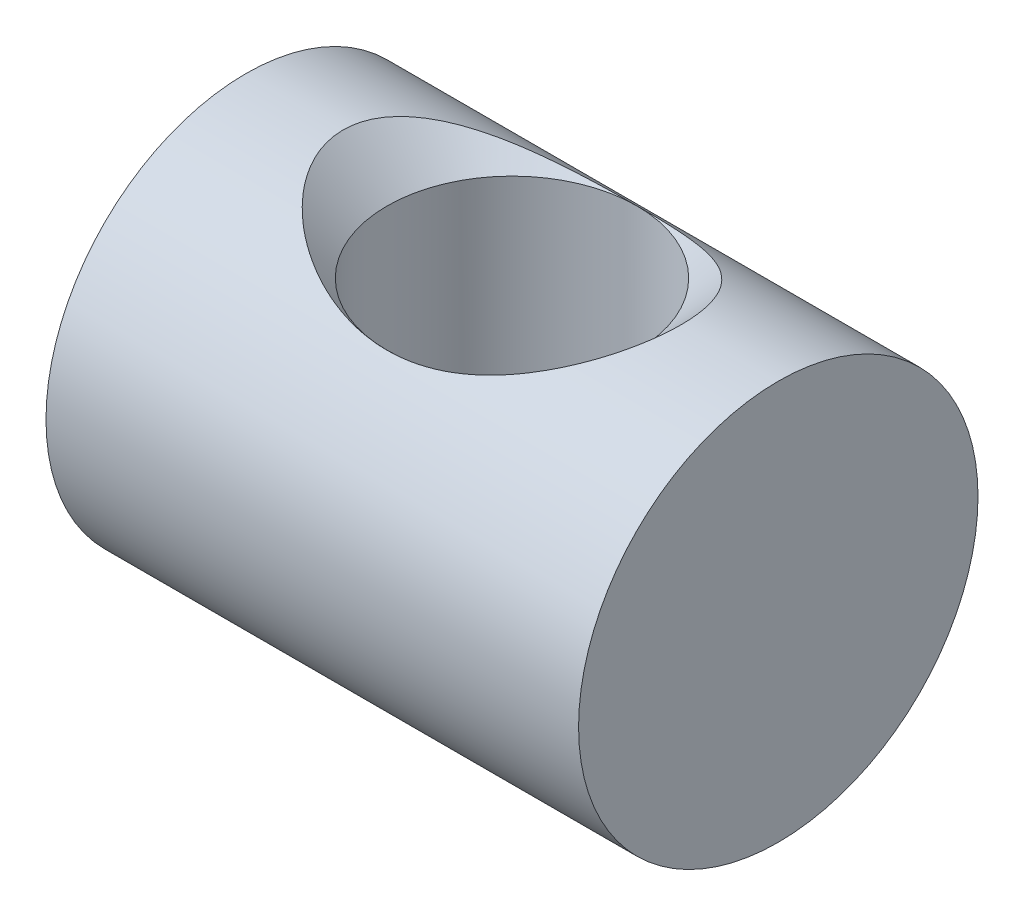
ISO-10303-21;
HEADER;
FILE_DESCRIPTION(('STEP AP214'),'2;1');
FILE_NAME('part.step','',(''),(''),'','','');
FILE_SCHEMA(('AUTOMOTIVE_DESIGN { 1 0 10303 214 1 1 1 1 }'));
ENDSEC;
DATA;
#1=APPLICATION_CONTEXT('core data for automotive mechanical design processes');
#2=APPLICATION_PROTOCOL_DEFINITION('international standard','automotive_design',2000,#1);
#3=PRODUCT_CONTEXT('',#1,'mechanical');
#4=PRODUCT('Part','Part','',(#3));
#5=PRODUCT_RELATED_PRODUCT_CATEGORY('part','',(#4));
#6=PRODUCT_DEFINITION_FORMATION('','',#4);
#7=PRODUCT_DEFINITION_CONTEXT('part definition',#1,'design');
#8=PRODUCT_DEFINITION('design','',#6,#7);
#9=PRODUCT_DEFINITION_SHAPE('','',#8);
#10=(LENGTH_UNIT() NAMED_UNIT(*) SI_UNIT(.MILLI.,.METRE.));
#11=(NAMED_UNIT(*) PLANE_ANGLE_UNIT() SI_UNIT($,.RADIAN.));
#12=(NAMED_UNIT(*) SI_UNIT($,.STERADIAN.) SOLID_ANGLE_UNIT());
#13=UNCERTAINTY_MEASURE_WITH_UNIT(LENGTH_MEASURE(1.E-05),#10,'distance_accuracy_value','');
#14=(GEOMETRIC_REPRESENTATION_CONTEXT(3) GLOBAL_UNCERTAINTY_ASSIGNED_CONTEXT((#13)) GLOBAL_UNIT_ASSIGNED_CONTEXT((#10,
#11,#12)) REPRESENTATION_CONTEXT('',''));
#15=CARTESIAN_POINT('',(0.,0.,0.));
#16=DIRECTION('',(0.,0.,1.));
#17=DIRECTION('',(1.,0.,0.));
#18=AXIS2_PLACEMENT_3D('',#15,#16,#17);
#19=CARTESIAN_POINT('',(20.,0.,0.));
#20=DIRECTION('',(-1.,0.,0.));
#21=DIRECTION('',(0.,0.,1.));
#22=AXIS2_PLACEMENT_3D('',#19,#20,#21);
#23=CYLINDRICAL_SURFACE('',#22,15.);
#24=CARTESIAN_POINT('',(0.,-11.7011194640089,-9.38529718703636));
#25=CARTESIAN_POINT('',(0.233269990120087,-11.7011231648777,-9.38529487569663));
#26=CARTESIAN_POINT('',(0.466583291006937,-11.7081253105593,-9.37658323404094));
#27=CARTESIAN_POINT('',(0.931203929736858,-11.7358205171603,-9.3418943774613));
#28=CARTESIAN_POINT('',(1.16251001438423,-11.7565215840382,-9.31590706620573));
#29=CARTESIAN_POINT('',(1.62153878722509,-11.8107377882137,-9.24707452764264));
#30=CARTESIAN_POINT('',(1.84925332966772,-11.8442786224833,-9.20419548890463));
#31=CARTESIAN_POINT('',(2.2991089152107,-11.9227930556617,-9.10225976245006));
#32=CARTESIAN_POINT('',(2.52124710975413,-11.9677723721538,-9.04319498306045));
#33=CARTESIAN_POINT('',(2.95656621527793,-12.0670195391487,-8.91032218130775));
#34=CARTESIAN_POINT('',(3.16981073799717,-12.1211981145719,-8.83665481717532));
#35=CARTESIAN_POINT('',(3.58866420398661,-12.2374096119118,-8.67500500215649));
#36=CARTESIAN_POINT('',(3.79427020306309,-12.2994455225609,-8.58701710044966));
#37=CARTESIAN_POINT('',(4.19704148638192,-12.4296031725306,-8.39750970015159));
#38=CARTESIAN_POINT('',(4.39420939805416,-12.4977229967613,-8.2959944547718));
#39=CARTESIAN_POINT('',(4.77967637337715,-12.6384057225505,-8.08005613776033));
#40=CARTESIAN_POINT('',(4.96797515691576,-12.7109687642721,-7.96563265883708));
#41=CARTESIAN_POINT('',(5.36003823049198,-12.8689478221348,-7.70817442783752));
#42=CARTESIAN_POINT('',(5.56246966734348,-12.9547786296102,-7.56336181872613));
#43=CARTESIAN_POINT('',(5.95474940122158,-13.127995799425,-7.25854352720121));
#44=CARTESIAN_POINT('',(6.1446001969479,-13.2153818484701,-7.09854087720256));
#45=CARTESIAN_POINT('',(6.51130675040878,-13.3898200392899,-6.76375447864141));
#46=CARTESIAN_POINT('',(6.68815093861111,-13.4768718200344,-6.58895786089232));
#47=CARTESIAN_POINT('',(7.02795432950042,-13.6486941754036,-6.2252401020354));
#48=CARTESIAN_POINT('',(7.19091083219608,-13.7334643042563,-6.03631622770285));
#49=CARTESIAN_POINT('',(7.52096315534589,-13.9089625994265,-5.6211662033375));
#50=CARTESIAN_POINT('',(7.68615657286418,-13.999163382838,-5.39319670163503));
#51=CARTESIAN_POINT('',(7.99646519803239,-14.1719106550174,-4.92138460702141));
#52=CARTESIAN_POINT('',(8.14158948085373,-14.2544605978543,-4.67754926240899));
#53=CARTESIAN_POINT('',(8.41019729653796,-14.4095662009578,-4.17533544849116));
#54=CARTESIAN_POINT('',(8.53369109500141,-14.4821265986395,-3.91696395523236));
#55=CARTESIAN_POINT('',(8.75741703760401,-14.6150761414859,-3.38733564962476));
#56=CARTESIAN_POINT('',(8.85765342362378,-14.6754675058756,-3.11608119786682));
#57=CARTESIAN_POINT('',(9.02429593897095,-14.776677532442,-2.5911046345927));
#58=CARTESIAN_POINT('',(9.09310717824609,-14.8188628257344,-2.33840870343763));
#59=CARTESIAN_POINT('',(9.20960745002179,-14.8906331243592,-1.82642627470063));
#60=CARTESIAN_POINT('',(9.25729778489536,-14.9202189066079,-1.56714018452883));
#61=CARTESIAN_POINT('',(9.33071984811632,-14.9658846595832,-1.04452856946287));
#62=CARTESIAN_POINT('',(9.35647086502425,-14.9819764936925,-0.781206800456643));
#63=CARTESIAN_POINT('',(9.3856187356035,-15.0001967004451,-0.252858266854061));
#64=CARTESIAN_POINT('',(9.38901817099365,-15.0023266857512,0.0121682972901637));
#65=CARTESIAN_POINT('',(9.37446713772455,-14.9932256982354,0.505609592646356));
#66=CARTESIAN_POINT('',(9.359331198772,-14.9837560359287,0.7341466295389));
#67=CARTESIAN_POINT('',(9.31249980540762,-14.9545481894758,1.18885625855108));
#68=CARTESIAN_POINT('',(9.28080452972985,-14.9348101161622,1.41502887616433));
#69=CARTESIAN_POINT('',(9.20126852930084,-14.8855153583912,1.86341413881899));
#70=CARTESIAN_POINT('',(9.1534279784296,-14.8559587796762,2.08562682648058));
#71=CARTESIAN_POINT('',(9.04218399533573,-14.7876759830185,2.52467880943954));
#72=CARTESIAN_POINT('',(8.9787799073825,-14.7489493787221,2.74151787790904));
#73=CARTESIAN_POINT('',(8.83695853542882,-14.6630434659748,3.1690385391493));
#74=CARTESIAN_POINT('',(8.75850867924934,-14.6158458333158,3.37970560833395));
#75=CARTESIAN_POINT('',(8.58743376548589,-14.5139757614074,3.79340347136382));
#76=CARTESIAN_POINT('',(8.49480400611803,-14.4593008434772,3.99643170439726));
#77=CARTESIAN_POINT('',(8.29620419302012,-14.3435244207793,4.39387560934778));
#78=CARTESIAN_POINT('',(8.19023705454805,-14.2824243208938,4.58829315085642));
#79=CARTESIAN_POINT('',(7.96568244538932,-14.1548491372319,4.96793404813507));
#80=CARTESIAN_POINT('',(7.84709045781847,-14.0883721317781,5.15315407825319));
#81=CARTESIAN_POINT('',(7.58255932515037,-13.9426590830069,5.53617992288414));
#82=CARTESIAN_POINT('',(7.43505301780881,-13.8628638129415,5.73269179526851));
#83=CARTESIAN_POINT('',(7.12589315075027,-13.6995370288372,6.11273178744587));
#84=CARTESIAN_POINT('',(6.96423317950299,-13.616003830002,6.29625395418813));
#85=CARTESIAN_POINT('',(6.62741456347592,-13.4468429378,6.64987770235236));
#86=CARTESIAN_POINT('',(6.45224027023948,-13.3612128971811,6.81996324990569));
#87=CARTESIAN_POINT('',(6.08923930967607,-13.1897474789934,7.14594177280559));
#88=CARTESIAN_POINT('',(5.9014120623333,-13.1039120921857,7.30183409675854));
#89=CARTESIAN_POINT('',(5.48824858546723,-12.9227786513337,7.61834919713035));
#90=CARTESIAN_POINT('',(5.26122374860158,-12.8277159719672,7.77691095433159));
#91=CARTESIAN_POINT('',(4.79248915597505,-12.6426968637769,8.07421108765032));
#92=CARTESIAN_POINT('',(4.55077664401429,-12.5527413995065,8.21294572665703));
#93=CARTESIAN_POINT('',(4.05395474733446,-12.3812953578663,8.46919475404787));
#94=CARTESIAN_POINT('',(3.79886597309467,-12.2997923022116,8.58674061839815));
#95=CARTESIAN_POINT('',(3.27619489927544,-12.1485465598337,8.7994241936051));
#96=CARTESIAN_POINT('',(3.00861800156681,-12.0787988473247,8.89457148750627));
#97=CARTESIAN_POINT('',(2.53465905703008,-11.9708960095073,9.03899838234434));
#98=CARTESIAN_POINT('',(2.33072558277488,-11.9292586515265,9.09375809984121));
#99=CARTESIAN_POINT('',(1.91800464048636,-11.8555368144063,9.18966347979357));
#100=CARTESIAN_POINT('',(1.70921836573079,-11.823450013075,9.23081245193598));
#101=CARTESIAN_POINT('',(1.28822347452982,-11.7699695006421,9.29890842115567));
#102=CARTESIAN_POINT('',(1.07601901128989,-11.7485636945343,9.3258714840453));
#103=CARTESIAN_POINT('',(0.649408706273265,-11.717196205182,9.36525240798774));
#104=CARTESIAN_POINT('',(0.435002830039822,-11.7072347013412,9.37767004102275));
#105=CARTESIAN_POINT('',(0.00511716070108171,-11.6991424684606,9.38776381472676));
#106=CARTESIAN_POINT('',(-0.21036397084095,-11.7010393909725,9.38540550072269));
#107=CARTESIAN_POINT('',(-0.640220741773456,-11.7166522377258,9.36590695474814));
#108=CARTESIAN_POINT('',(-0.854596374868639,-11.7303682291966,9.34876663869446));
#109=CARTESIAN_POINT('',(-1.28079926071444,-11.7690934949367,9.29996786707364));
#110=CARTESIAN_POINT('',(-1.49262458548415,-11.7941108222583,9.26829905861145));
#111=CARTESIAN_POINT('',(-1.91217431759076,-11.8545137132174,9.19091429370104));
#112=CARTESIAN_POINT('',(-2.1198986237297,-11.8898995323704,9.14519799107262));
#113=CARTESIAN_POINT('',(-2.52655062378408,-11.969150443892,9.04121825426629));
#114=CARTESIAN_POINT('',(-2.72556832970844,-12.0128582516493,8.98318557162803));
#115=CARTESIAN_POINT('',(-3.11773666686116,-12.107858987085,8.85472349558496));
#116=CARTESIAN_POINT('',(-3.31088528143355,-12.1591544871966,8.78428989638669));
#117=CARTESIAN_POINT('',(-3.8804236540718,-12.3224040874864,8.55532011343318));
#118=CARTESIAN_POINT('',(-4.24710879771458,-12.443763167428,8.37906225176996));
#119=CARTESIAN_POINT('',(-5.01795208475962,-12.7257044848235,7.94576029808261));
#120=CARTESIAN_POINT('',(-5.41592863745033,-12.8893536819034,7.67972112774915));
#121=CARTESIAN_POINT('',(-5.97812652677457,-13.1387247301668,7.23896533693171));
#122=CARTESIAN_POINT('',(-6.15986271391727,-13.2225665627097,7.08495735588106));
#123=CARTESIAN_POINT('',(-6.51127384978253,-13.3898833179547,6.76341840938014));
#124=CARTESIAN_POINT('',(-6.68094666225221,-13.473358173227,6.59588505994053));
#125=CARTESIAN_POINT('',(-7.03391762309375,-13.6515707594973,6.21969920526849));
#126=CARTESIAN_POINT('',(-7.21498583433366,-13.745948333916,6.00877717624698));
#127=CARTESIAN_POINT('',(-7.55862168749474,-13.9293884489696,5.57033047360278));
#128=CARTESIAN_POINT('',(-7.72119624614742,-14.0184529707498,5.34281205972215));
#129=CARTESIAN_POINT('',(-8.02651973057399,-14.1889103467831,4.87211107623476));
#130=CARTESIAN_POINT('',(-8.16926952299663,-14.2703035363421,4.62892919204452));
#131=CARTESIAN_POINT('',(-8.43336692517171,-14.4231159858124,4.1282208085636));
#132=CARTESIAN_POINT('',(-8.55471722622423,-14.4945364996985,3.87069611845923));
#133=CARTESIAN_POINT('',(-8.76787184025792,-14.6213844191311,3.35864739154655));
#134=CARTESIAN_POINT('',(-8.86099981408748,-14.6775082278295,3.10484793497867));
#135=CARTESIAN_POINT('',(-9.02552297252663,-14.7774146924628,2.58791200735358));
#136=CARTESIAN_POINT('',(-9.09691865826103,-14.8211976329641,2.32477575174985));
#137=CARTESIAN_POINT('',(-9.21672346889729,-14.8950315155359,1.79174283800536));
#138=CARTESIAN_POINT('',(-9.26515913814032,-14.9250983134761,1.5218543682565));
#139=CARTESIAN_POINT('',(-9.33827020426465,-14.9705931845458,0.977671560787921));
#140=CARTESIAN_POINT('',(-9.3629495565531,-14.9860236945989,0.703377964252961));
#141=CARTESIAN_POINT('',(-9.3862235181122,-15.000577816115,0.194048011580732));
#142=CARTESIAN_POINT('',(-9.38814045404693,-15.0017783347203,-0.0407850115252511));
#143=CARTESIAN_POINT('',(-9.37437973075437,-14.9931704155292,-0.509714284529572));
#144=CARTESIAN_POINT('',(-9.35870417017784,-14.9833632908607,-0.743810618968875));
#145=CARTESIAN_POINT('',(-9.30998467354272,-14.9529813422861,-1.20946099970367));
#146=CARTESIAN_POINT('',(-9.27694154374565,-14.9324070182302,-1.44101516350597));
#147=CARTESIAN_POINT('',(-9.19393955753351,-14.8809831865376,-1.89990753815991));
#148=CARTESIAN_POINT('',(-9.14398035406719,-14.8501334680905,-2.12724566241407));
#149=CARTESIAN_POINT('',(-9.02985368381542,-14.7801386796356,-2.56818156270548));
#150=CARTESIAN_POINT('',(-8.96625488806906,-14.7413277505129,-2.78198043900607));
#151=CARTESIAN_POINT('',(-8.82457800445613,-14.6555857244439,-3.2031242513344));
#152=CARTESIAN_POINT('',(-8.74649490778271,-14.6086518188735,-3.41046692569174));
#153=CARTESIAN_POINT('',(-8.57663377846074,-14.507590629688,-3.81756362801019));
#154=CARTESIAN_POINT('',(-8.48485967403676,-14.4534654098907,-4.01731981212952));
#155=CARTESIAN_POINT('',(-8.28832760518083,-14.3389745413875,-4.40855709555659));
#156=CARTESIAN_POINT('',(-8.18356494691823,-14.278606638003,-4.60003516939154));
#157=CARTESIAN_POINT('',(-7.95036728853401,-14.1461794915318,-4.99329308970248));
#158=CARTESIAN_POINT('',(-7.82060502302149,-14.0735566450528,-5.19409640406509));
#159=CARTESIAN_POINT('',(-7.54707390455039,-13.9234135921372,-5.58410648671106));
#160=CARTESIAN_POINT('',(-7.40329890272888,-13.8458912410647,-5.77330810424313));
#161=CARTESIAN_POINT('',(-7.10248856170527,-13.6874096290474,-6.13959847772485));
#162=CARTESIAN_POINT('',(-6.94544261174525,-13.606447644164,-6.31667733223333));
#163=CARTESIAN_POINT('',(-6.61890206585658,-13.4426971367071,-6.65805837315176));
#164=CARTESIAN_POINT('',(-6.4494065330108,-13.3599084769924,-6.82235959603708));
#165=CARTESIAN_POINT('',(-6.07319365107372,-13.1821298429088,-7.16051787259003));
#166=CARTESIAN_POINT('',(-5.86463859396265,-13.0871071543705,-7.33231950600608));
#167=CARTESIAN_POINT('',(-5.43278755208587,-12.8993628708853,-7.65778975423574));
#168=CARTESIAN_POINT('',(-5.20948890293947,-12.8066416960438,-7.8114550774919));
#169=CARTESIAN_POINT('',(-4.74905994077326,-12.6263581643901,-8.09962653588923));
#170=CARTESIAN_POINT('',(-4.51193779222228,-12.5387928226453,-8.23414382189023));
#171=CARTESIAN_POINT('',(-4.02449783633376,-12.3717575546129,-8.48304732696133));
#172=CARTESIAN_POINT('',(-3.77417760519242,-12.2922891232213,-8.59742983146361));
#173=CARTESIAN_POINT('',(-3.31790465090504,-12.1609214866344,-8.78190465988815));
#174=CARTESIAN_POINT('',(-3.11428626419628,-12.1068010444839,-8.85620656617072));
#175=CARTESIAN_POINT('',(-2.70060423077396,-12.0070484672197,-8.99098541817359));
#176=CARTESIAN_POINT('',(-2.49054459009379,-11.9614111760651,-9.05147076671928));
#177=CARTESIAN_POINT('',(-2.06540555686762,-11.8801799680019,-9.15782717982203));
#178=CARTESIAN_POINT('',(-1.85033976578717,-11.8445616502931,-9.20373378614805));
#179=CARTESIAN_POINT('',(-1.41606852659242,-11.7845350306371,-9.28047001228447));
#180=CARTESIAN_POINT('',(-1.19686525482494,-11.7601209973094,-9.31130734107809));
#181=CARTESIAN_POINT('',(-0.814607163648517,-11.7283316183004,-9.35129341736302));
#182=CARTESIAN_POINT('',(-0.652149602654256,-11.7181498993321,-9.36403138641946));
#183=CARTESIAN_POINT('',(-0.32646855399651,-11.7045416696608,-9.38103515554443));
#184=CARTESIAN_POINT('',(-0.163244882403928,-11.7011168741005,-9.38529880453711));
#185=CARTESIAN_POINT('',(0.,-11.7011194640089,-9.38529718703636));
#186=B_SPLINE_CURVE_WITH_KNOTS('',3,(#24,#25,#26,#27,#28,#29,#30,#31,#32,#33,#34,#35,#36,#37,
#38,#39,#40,#41,#42,#43,#44,#45,#46,#47,#48,#49,#50,#51,#52,#53,#54,#55,#56,#57,#58,#59,#60,#61,
#62,#63,#64,#65,#66,#67,#68,#69,#70,#71,#72,#73,#74,#75,#76,#77,#78,#79,#80,#81,#82,#83,#84,#85,
#86,#87,#88,#89,#90,#91,#92,#93,#94,#95,#96,#97,#98,#99,#100,#101,#102,#103,#104,#105,#106,#107,
#108,#109,#110,#111,#112,#113,#114,#115,#116,#117,#118,#119,#120,#121,#122,#123,#124,#125,#126,
#127,#128,#129,#130,#131,#132,#133,#134,#135,#136,#137,#138,#139,#140,#141,#142,#143,#144,#145,
#146,#147,#148,#149,#150,#151,#152,#153,#154,#155,#156,#157,#158,#159,#160,#161,#162,#163,#164,
#165,#166,#167,#168,#169,#170,#171,#172,#173,#174,#175,#176,#177,#178,#179,#180,#181,#182,#183,
#184,#185),.UNSPECIFIED.,.T.,.F.,(4,2,2,2,2,2,2,2,2,2,2,2,2,2,2,2,2,2,2,2,2,2,2,2,2,2,2,2,2,2,2,
2,2,2,2,2,2,2,2,2,2,2,2,2,2,2,2,2,2,2,2,2,2,2,2,2,2,2,2,2,2,2,2,2,2,2,2,2,2,2,2,2,2,2,2,2,2,2,2,
2,4),(0.,0.699621906909464,1.39965305016783,2.10109259356724,2.80288344660592,3.4982168860561,
4.19381561162522,4.88919614370394,5.58459862316147,6.37366287918338,7.16256994282186,
7.95217046804104,8.74192415586739,9.62762680084961,10.5129276162472,11.397807131993,
12.2825251289527,13.0771812369299,13.8717883374028,14.6656961139483,15.4595121885867,
16.1463865809935,16.8332535597397,17.5201131413616,18.207001667058,18.8953943561238,
19.5840157994033,20.2724869857137,20.9612053245117,21.7354616370534,22.5100705162358,
23.2855901930631,24.0611454442044,24.9384151914402,25.8158500732414,26.6919705849267,
27.567715571611,28.2127571764236,28.8576418127622,29.5017945242462,30.1459573334941,
30.7916227649353,31.4372918690839,32.0834217885905,32.7295676323124,33.3645349822828,
33.9997180988774,35.2694491686361,36.7812266527102,37.5383272037377,38.2955614943301,
39.1751806568281,40.0544697475253,40.9337203875885,41.8128603699963,42.6399652575339,
43.4670510714154,44.2931783355452,45.1191680263639,45.8228073712778,46.5263627863017,
47.2298855427796,47.933422733651,48.6119321960756,49.2906767323202,49.9692268963762,
50.6480229950006,51.3968798547949,52.146066809216,52.8958585472156,53.6457067701522,
54.5040184536375,55.3624856732773,56.2204509011462,57.0785742453367,57.748175756635,
58.4173689452219,59.0849179441812,59.7521250869789,60.2416038945267,60.7312069328851),.UNSPECIFIED.);
#187=CARTESIAN_POINT('',(0.,-11.7011194640089,-9.38529718703636));
#188=VERTEX_POINT('',#187);
#189=EDGE_CURVE('E60',#188,#188,#186,.T.);
#190=ORIENTED_EDGE('',*,*,#189,.F.);
#191=EDGE_LOOP('',(#190));
#192=FACE_BOUND('',#191,.T.);
#193=CARTESIAN_POINT('',(20.,0.,0.));
#194=DIRECTION('',(1.,0.,0.));
#195=DIRECTION('',(0.,0.,-1.));
#196=AXIS2_PLACEMENT_3D('',#193,#194,#195);
#197=CIRCLE('',#196,15.);
#198=CARTESIAN_POINT('',(20.,0.,-15.));
#199=VERTEX_POINT('',#198);
#200=EDGE_CURVE('E56',#199,#199,#197,.T.);
#201=ORIENTED_EDGE('',*,*,#200,.F.);
#202=EDGE_LOOP('',(#201));
#203=FACE_BOUND('',#202,.T.);
#204=CARTESIAN_POINT('',(-20.,0.,0.));
#205=DIRECTION('',(1.,0.,0.));
#206=DIRECTION('',(0.,0.,-1.));
#207=AXIS2_PLACEMENT_3D('',#204,#205,#206);
#208=CIRCLE('',#207,15.);
#209=CARTESIAN_POINT('',(-20.,0.,-15.));
#210=VERTEX_POINT('',#209);
#211=EDGE_CURVE('E78',#210,#210,#208,.T.);
#212=ORIENTED_EDGE('',*,*,#211,.T.);
#213=EDGE_LOOP('',(#212));
#214=FACE_BOUND('',#213,.T.);
#215=CARTESIAN_POINT('',(-11.6912135697195,14.5557273471736,-3.62364476663233));
#216=CARTESIAN_POINT('',(-11.8792292431533,14.637759258491,-3.29407100181605));
#217=CARTESIAN_POINT('',(-12.0455902093742,14.7115626114202,-2.9496857010425));
#218=CARTESIAN_POINT('',(-12.2553986873146,14.8054453233578,-2.41489163432108));
#219=CARTESIAN_POINT('',(-12.318718528265,14.8339385417523,-2.23356530988771));
#220=CARTESIAN_POINT('',(-12.4310658801513,14.8846733982811,-1.86571565388014));
#221=CARTESIAN_POINT('',(-12.4800998974883,14.906917882202,-1.67919473069873));
#222=CARTESIAN_POINT('',(-12.5632182361202,14.9447148734097,-1.30074215066232));
#223=CARTESIAN_POINT('',(-12.5971915476391,14.9602176735307,-1.10878106185201));
#224=CARTESIAN_POINT('',(-12.6489245615064,14.9838538509017,-0.722224274047173));
#225=CARTESIAN_POINT('',(-12.6666844501777,14.9919873128393,-0.527628605355018));
#226=CARTESIAN_POINT('',(-12.6855730530774,15.000638382196,-0.13750592160488));
#227=CARTESIAN_POINT('',(-12.6867056838805,15.0011577831184,0.0580208632722056));
#228=CARTESIAN_POINT('',(-12.672321780173,14.9945688315289,0.448323742604568));
#229=CARTESIAN_POINT('',(-12.6568060782515,14.9874608604648,0.643099874111422));
#230=CARTESIAN_POINT('',(-12.6116420257145,14.9668165108845,1.01266948454255));
#231=CARTESIAN_POINT('',(-12.5834023298496,14.9539212908539,1.18767380505044));
#232=CARTESIAN_POINT('',(-12.5139722951326,14.9223087065244,1.53461955691331));
#233=CARTESIAN_POINT('',(-12.4727771067224,14.9035891620665,1.70655981580663));
#234=CARTESIAN_POINT('',(-12.3781386671363,14.8607480944577,2.04633609085884));
#235=CARTESIAN_POINT('',(-12.3246952273252,14.8366264881098,2.21417204376329));
#236=CARTESIAN_POINT('',(-12.2063774349614,14.7834762255126,2.54497864128965));
#237=CARTESIAN_POINT('',(-12.14150056832,14.7544464900751,2.70794820660881));
#238=CARTESIAN_POINT('',(-11.9772283476646,14.681356167291,3.08313218069769));
#239=CARTESIAN_POINT('',(-11.8736092870246,14.6355472099364,3.29316879432388));
#240=CARTESIAN_POINT('',(-11.6495381272232,14.5374193552325,3.70240279255265));
#241=CARTESIAN_POINT('',(-11.5290811308358,14.4850985644374,3.90159700019555));
#242=CARTESIAN_POINT('',(-11.1450467593728,14.3201525405367,4.48279906565344));
#243=CARTESIAN_POINT('',(-10.8590081710673,14.1996353044916,4.84798098963494));
#244=CARTESIAN_POINT('',(-10.3339065801835,13.9851640640223,5.42960664275298));
#245=CARTESIAN_POINT('',(-10.1063487599804,13.8940342203263,5.65788738593488));
#246=CARTESIAN_POINT('',(-9.63211555305593,13.7089479190781,6.09266055701137));
#247=CARTESIAN_POINT('',(-9.38543242451757,13.6149903263841,6.29914408079997));
#248=CARTESIAN_POINT('',(-8.87566549467304,13.4267458011792,6.69102556037097));
#249=CARTESIAN_POINT('',(-8.61256602508027,13.3324586376896,6.87640288002087));
#250=CARTESIAN_POINT('',(-8.07238317436389,13.1459531544587,7.22656521106391));
#251=CARTESIAN_POINT('',(-7.79530120182489,13.0537346276714,7.39135229090847));
#252=CARTESIAN_POINT('',(-7.21953714364572,12.8705526073198,7.70604372556336));
#253=CARTESIAN_POINT('',(-6.92044399700168,12.7797309548073,7.85527750089723));
#254=CARTESIAN_POINT('',(-6.31079377426366,12.6048969622841,8.13286390175526));
#255=CARTESIAN_POINT('',(-6.0002362142276,12.5208849102035,8.26121564455617));
#256=CARTESIAN_POINT('',(-5.36922523421874,12.3619330458319,8.49722612563972));
#257=CARTESIAN_POINT('',(-5.0487754136927,12.2869899813714,8.60489229002901));
#258=CARTESIAN_POINT('',(-4.3992861882915,12.1482785183108,8.79963738906581));
#259=CARTESIAN_POINT('',(-4.07024602187084,12.0845111143393,8.88671449153702));
#260=CARTESIAN_POINT('',(-3.34620480923832,11.9600302385706,9.05375197171107));
#261=CARTESIAN_POINT('',(-2.94983448339828,11.9018537101446,9.12972668131439));
#262=CARTESIAN_POINT('',(-2.15008110708556,11.8065265418523,9.25267538857514));
#263=CARTESIAN_POINT('',(-1.74669752605334,11.7693774999322,9.29964718223249));
#264=CARTESIAN_POINT('',(-0.936348187191417,11.7180374018679,9.36425758631409));
#265=CARTESIAN_POINT('',(-0.529384612853145,11.7038332117116,9.38191297809268));
#266=CARTESIAN_POINT('',(0.284868491905277,11.6991145522421,9.38779762365416));
#267=CARTESIAN_POINT('',(0.692157992331888,11.7085981086197,9.37602932982102));
#268=CARTESIAN_POINT('',(1.47431529124412,11.7492050249413,9.32507988371514));
#269=CARTESIAN_POINT('',(1.84940303847962,11.7787185075367,9.2879368153792));
#270=CARTESIAN_POINT('',(2.59428306431293,11.8563471959052,9.18863400294817));
#271=CARTESIAN_POINT('',(2.96407543965758,11.9044620613786,9.12647471650668));
#272=CARTESIAN_POINT('',(3.69654768076191,12.0173528366809,8.97730311968234));
#273=CARTESIAN_POINT('',(4.05921692821522,12.082151847807,8.89025633081884));
#274=CARTESIAN_POINT('',(4.77486542056109,12.2258843389268,8.691534725391));
#275=CARTESIAN_POINT('',(5.12784440660338,12.3048181960736,8.57985925165351));
#276=CARTESIAN_POINT('',(5.83439520699808,12.477028425391,8.32753870261895));
#277=CARTESIAN_POINT('',(6.18755509863082,12.5707101911997,8.18601625480324));
#278=CARTESIAN_POINT('',(6.87944866832356,12.7670638037365,7.87627526900307));
#279=CARTESIAN_POINT('',(7.21818001944228,12.8697370924609,7.70805244547574));
#280=CARTESIAN_POINT('',(7.87850473127992,13.0806343097196,7.34446309569331));
#281=CARTESIAN_POINT('',(8.20011565708711,13.188852316663,7.14912516147422));
#282=CARTESIAN_POINT('',(8.82351517580263,13.4073935677199,6.73034546560528));
#283=CARTESIAN_POINT('',(9.12531253904164,13.517715852099,6.50691626777284));
#284=CARTESIAN_POINT('',(9.8077932507275,13.7753863199675,5.94680474516836));
#285=CARTESIAN_POINT('',(10.1788974977466,13.9221125242904,5.59792563282354));
#286=CARTESIAN_POINT('',(10.8650898240954,14.2018803229078,4.84434554971197));
#287=CARTESIAN_POINT('',(11.180276137993,14.3349457391088,4.43974473593606));
#288=CARTESIAN_POINT('',(11.6749305570648,14.5480748025387,3.67082368749493));
#289=CARTESIAN_POINT('',(11.8689944441137,14.6333468203692,3.31750210991995));
#290=CARTESIAN_POINT('',(12.1183191476142,14.7440803147435,2.76540368574043));
#291=CARTESIAN_POINT('',(12.1944772426204,14.7781344553658,2.57764271282571));
#292=CARTESIAN_POINT('',(12.3315362441407,14.8396957324338,2.19563027591668));
#293=CARTESIAN_POINT('',(12.3924442808087,14.8672059281945,2.00138189343657));
#294=CARTESIAN_POINT('',(12.4982538115252,14.9151485806835,1.6057448415043));
#295=CARTESIAN_POINT('',(12.5430019883068,14.935513194424,1.40430673539817));
#296=CARTESIAN_POINT('',(12.6146438155169,14.9681784888093,0.997614103134963));
#297=CARTESIAN_POINT('',(12.64153754308,14.9804792042916,0.792359593469385));
#298=CARTESIAN_POINT('',(12.6767697646931,14.9966031609904,0.380045193426571));
#299=CARTESIAN_POINT('',(12.6851189724977,15.000431297079,0.172986414890619));
#300=CARTESIAN_POINT('',(12.6830681695505,14.9994915905096,-0.241006570035856));
#301=CARTESIAN_POINT('',(12.6726700902965,14.9947246333878,-0.447940787062445));
#302=CARTESIAN_POINT('',(12.6360810712263,14.9779847829278,-0.831693044840795));
#303=CARTESIAN_POINT('',(12.6122251988618,14.967077744954,-1.00878656158394));
#304=CARTESIAN_POINT('',(12.5511749578921,14.9392378386942,-1.36024028770822));
#305=CARTESIAN_POINT('',(12.5139757730701,14.9223027946398,-1.53459948639964));
#306=CARTESIAN_POINT('',(12.4269002396787,14.8828013085997,-1.87945519953867));
#307=CARTESIAN_POINT('',(12.37702400407,14.8602349167931,-2.04995174839028));
#308=CARTESIAN_POINT('',(12.2653968870806,14.8099548518691,-2.38624471931838));
#309=CARTESIAN_POINT('',(12.203643461469,14.7822400759521,-2.55204012560907));
#310=CARTESIAN_POINT('',(12.0486576344242,14.7130578195553,-2.92791759789461));
#311=CARTESIAN_POINT('',(11.9515648781978,14.6699719535841,-3.13611976334271));
#312=CARTESIAN_POINT('',(11.7407139745616,14.5772261850099,-3.54230827611066));
#313=CARTESIAN_POINT('',(11.6269514917486,14.5275645725349,-3.74029194767266));
#314=CARTESIAN_POINT('',(11.2631702451462,14.3704171000931,-4.31865054544817));
#315=CARTESIAN_POINT('',(10.9908269830725,14.2548455770345,-4.68303711306046));
#316=CARTESIAN_POINT('',(10.4895397005061,14.04823260462,-5.26419891111636));
#317=CARTESIAN_POINT('',(10.2721491720166,13.96025686447,-5.49242578544318));
#318=CARTESIAN_POINT('',(9.8183446977575,13.7809649010809,-5.92793388046669));
#319=CARTESIAN_POINT('',(9.58192309193876,13.6896473408988,-6.13520659057925));
#320=CARTESIAN_POINT('',(9.09275533141388,13.5060618781561,-6.52944501062062));
#321=CARTESIAN_POINT('',(8.83999332131059,13.4137931278592,-6.71639051039301));
#322=CARTESIAN_POINT('',(8.32055122382554,13.2305949047714,-7.07043604173089));
#323=CARTESIAN_POINT('',(8.05387250964179,13.1396653009743,-7.2375380259989));
#324=CARTESIAN_POINT('',(7.4990404198541,12.9581561273248,-7.55785837958234));
#325=CARTESIAN_POINT('',(7.21046512571519,12.867693692049,-7.71041107707348));
#326=CARTESIAN_POINT('',(6.62186051510024,12.692559821211,-7.99542988539753));
#327=CARTESIAN_POINT('',(6.32183056351594,12.6078887074796,-8.12789488042891));
#328=CARTESIAN_POINT('',(5.71179108016118,12.4464689687854,-8.37298877557646));
#329=CARTESIAN_POINT('',(5.40178395928234,12.3697184484618,-8.48562242581657));
#330=CARTESIAN_POINT('',(4.77303489010794,12.2261495306757,-8.69120144692024));
#331=CARTESIAN_POINT('',(4.45429206177718,12.1593321382647,-8.78414482589113));
#332=CARTESIAN_POINT('',(3.74408785209063,12.0252287062068,-8.96712195458969));
#333=CARTESIAN_POINT('',(3.35097614969984,11.9605899305789,-9.05275183772837));
#334=CARTESIAN_POINT('',(2.55675906502911,11.8514560816877,-9.19516488527782));
#335=CARTESIAN_POINT('',(2.15565297050311,11.8069628117033,-9.25194546736477));
#336=CARTESIAN_POINT('',(1.34873452974724,11.7403769097474,-9.33629791435965));
#337=CARTESIAN_POINT('',(0.942924877255118,11.718272040531,-9.36388573606757));
#338=CARTESIAN_POINT('',(0.129797212810821,11.6976055343042,-9.38969198948148));
#339=CARTESIAN_POINT('',(-0.277520653681547,11.6990416831138,-9.38791318330234));
#340=CARTESIAN_POINT('',(-1.06355490086451,11.7245010609083,-9.35608994579575));
#341=CARTESIAN_POINT('',(-1.44239736332174,11.7470388402435,-9.32790433729929));
#342=CARTESIAN_POINT('',(-2.19563779922829,11.8115378982681,-9.24609528785033));
#343=CARTESIAN_POINT('',(-2.57003583328225,11.8534989117878,-9.19247219417506));
#344=CARTESIAN_POINT('',(-3.31219872352066,11.9550502460827,-9.06000673244793));
#345=CARTESIAN_POINT('',(-3.67995811257715,12.0146544514266,-8.98114449810009));
#346=CARTESIAN_POINT('',(-4.40636854505215,12.1490809200984,-8.7984475358933));
#347=CARTESIAN_POINT('',(-4.76501929050949,12.2239036805348,-8.69461199226994));
#348=CARTESIAN_POINT('',(-5.47782487812147,12.387543178206,-8.4598827618291));
#349=CARTESIAN_POINT('',(-5.83177169143253,12.4765945226544,-8.32852129246642));
#350=CARTESIAN_POINT('',(-6.52621121731373,12.6645829097002,-8.03977725453019));
#351=CARTESIAN_POINT('',(-6.86670277099048,12.7635208012416,-7.88239245060849));
#352=CARTESIAN_POINT('',(-7.53243907021374,12.9682065402685,-7.54090836638979));
#353=CARTESIAN_POINT('',(-7.85766571704477,13.0739621353985,-7.35677838424874));
#354=CARTESIAN_POINT('',(-8.48983245064112,13.2888415602759,-6.96113282191546));
#355=CARTESIAN_POINT('',(-8.79677623931258,13.3979647013243,-6.74962281333205));
#356=CARTESIAN_POINT('',(-9.35159808327134,13.6022291498205,-6.32671243959014));
#357=CARTESIAN_POINT('',(-9.60203524009676,13.6973922675779,-6.11868548876685));
#358=CARTESIAN_POINT('',(-10.0836484416669,13.8850094811031,-5.68009045645069));
#359=CARTESIAN_POINT('',(-10.3148210670863,13.977463094072,-5.44951838906792));
#360=CARTESIAN_POINT('',(-10.7533018893584,14.1563736176769,-4.96620210780803));
#361=CARTESIAN_POINT('',(-10.9607014573423,14.2428529432434,-4.71354984873672));
#362=CARTESIAN_POINT('',(-11.3479115391372,14.4068652491651,-4.18553141905348));
#363=CARTESIAN_POINT('',(-11.5277470487323,14.484406318942,-3.91018617969226));
#364=CARTESIAN_POINT('',(-11.6912135697195,14.5557273471736,-3.62364476663233));
#365=B_SPLINE_CURVE_WITH_KNOTS('',3,(#215,#216,#217,#218,#219,#220,#221,#222,#223,#224,#225,
#226,#227,#228,#229,#230,#231,#232,#233,#234,#235,#236,#237,#238,#239,#240,#241,#242,#243,#244,
#245,#246,#247,#248,#249,#250,#251,#252,#253,#254,#255,#256,#257,#258,#259,#260,#261,#262,#263,
#264,#265,#266,#267,#268,#269,#270,#271,#272,#273,#274,#275,#276,#277,#278,#279,#280,#281,#282,
#283,#284,#285,#286,#287,#288,#289,#290,#291,#292,#293,#294,#295,#296,#297,#298,#299,#300,#301,
#302,#303,#304,#305,#306,#307,#308,#309,#310,#311,#312,#313,#314,#315,#316,#317,#318,#319,#320,
#321,#322,#323,#324,#325,#326,#327,#328,#329,#330,#331,#332,#333,#334,#335,#336,#337,#338,#339,
#340,#341,#342,#343,#344,#345,#346,#347,#348,#349,#350,#351,#352,#353,#354,#355,#356,#357,#358,
#359,#360,#361,#362,#363,#364),.UNSPECIFIED.,.T.,.F.,(4,2,2,2,2,2,2,2,2,2,2,2,2,2,2,2,2,2,2,2,2,
2,2,2,2,2,2,2,2,2,2,2,2,2,2,2,2,2,2,2,2,2,2,2,2,2,2,2,2,2,2,2,2,2,2,2,2,2,2,2,2,2,2,2,2,2,2,2,2,
2,2,2,2,2,4),(0.,1.16353625951858,1.74546096143024,2.32712021308256,2.91299824473589,
3.49886954346144,4.08460283713792,4.67030683944372,5.20291570009766,5.73572416705908,
6.26854084035039,6.8014748208702,7.51631152873369,8.23135657740089,9.6629211447267,
10.666693221044,11.6708737616644,12.676027836354,13.681080854095,14.7193004817519,
15.7575639855315,16.7954540541729,17.833436447686,19.0550861632663,20.2768287034715,
21.4978716499339,22.7188128291882,23.8517056769013,24.9845778001024,26.1190270426524,
27.2535065596492,28.4277056746628,29.602093445404,30.7752521373449,31.9478879882211,
33.5328793327558,35.1150580397336,36.3459862717356,36.961711532959,37.5771483724278,
38.1982796299834,38.819408204122,39.4401778392331,40.0608835212704,40.5973427386487,
41.1339957840641,41.6706440477172,42.20740739589,42.9075450523874,43.6078651224513,
45.0098013394159,45.9904289226839,46.9714532034413,47.9534441085185,48.9353383004953,
49.9506347452365,50.9659875654989,51.9810968504588,52.9963087761706,54.217186400519,
55.438173287348,56.6584924359027,57.8786968064698,59.018986659696,60.1592609459228,
61.3004349843236,62.4416463047529,63.6041050194532,64.7666636387648,65.9305675094894,
67.094234906629,68.1106406837657,69.1272264835697,70.1397638452255,71.1513775097257),.UNSPECIFIED.);
#366=CARTESIAN_POINT('',(0.,11.7011194640089,9.38529718703636));
#367=VERTEX_POINT('',#366);
#368=CARTESIAN_POINT('',(0.,11.7011194640089,-9.38529718703636));
#369=VERTEX_POINT('',#368);
#370=EDGE_CURVE('E57',#367,#369,#365,.T.);
#371=ORIENTED_EDGE('',*,*,#370,.F.);
#372=EDGE_CURVE('E55',#369,#367,#365,.T.);
#373=ORIENTED_EDGE('',*,*,#372,.F.);
#374=EDGE_LOOP('',(#371,#373));
#375=FACE_BOUND('',#374,.T.);
#376=ADVANCED_FACE('F33',(#192,#203,#214,#375),#23,.T.);
#377=CARTESIAN_POINT('',(0.,34.,0.));
#378=DIRECTION('',(0.,-1.,0.));
#379=DIRECTION('',(0.,0.,-1.));
#380=AXIS2_PLACEMENT_3D('',#377,#378,#379);
#381=CYLINDRICAL_SURFACE('',#380,9.38529718703636);
#382=ORIENTED_EDGE('',*,*,#189,.T.);
#383=EDGE_LOOP('',(#382));
#384=FACE_BOUND('',#383,.T.);
#385=CARTESIAN_POINT('',(0.,11.7011194640089,0.));
#386=DIRECTION('',(0.,1.,0.));
#387=DIRECTION('',(0.,0.,1.));
#388=AXIS2_PLACEMENT_3D('',#385,#386,#387);
#389=CIRCLE('',#388,9.38529718703636);
#390=EDGE_CURVE('E37',#369,#367,#389,.T.);
#391=ORIENTED_EDGE('',*,*,#390,.T.);
#392=EDGE_CURVE('E11',#367,#369,#389,.T.);
#393=ORIENTED_EDGE('',*,*,#392,.T.);
#394=EDGE_LOOP('',(#391,#393));
#395=FACE_BOUND('',#394,.T.);
#396=ADVANCED_FACE('F50',(#384,#395),#381,.F.);
#397=CARTESIAN_POINT('',(20.,0.,0.));
#398=DIRECTION('',(1.,0.,0.));
#399=DIRECTION('',(0.,0.,-1.));
#400=AXIS2_PLACEMENT_3D('',#397,#398,#399);
#401=PLANE('',#400);
#402=ORIENTED_EDGE('',*,*,#200,.T.);
#403=EDGE_LOOP('',(#402));
#404=FACE_BOUND('',#403,.T.);
#405=ADVANCED_FACE('F73',(#404),#401,.T.);
#406=CARTESIAN_POINT('',(-20.,0.,0.));
#407=DIRECTION('',(1.,0.,0.));
#408=DIRECTION('',(0.,0.,-1.));
#409=AXIS2_PLACEMENT_3D('',#406,#407,#408);
#410=PLANE('',#409);
#411=ORIENTED_EDGE('',*,*,#211,.F.);
#412=EDGE_LOOP('',(#411));
#413=FACE_BOUND('',#412,.T.);
#414=ADVANCED_FACE('F103',(#413),#410,.F.);
#415=CARTESIAN_POINT('',(0.,32.7567394609911,0.));
#416=DIRECTION('',(0.,1.,0.));
#417=DIRECTION('',(0.,0.,1.));
#418=AXIS2_PLACEMENT_3D('',#415,#416,#417);
#419=CONICAL_SURFACE('',#418,30.4409171840183,0.785398163397443);
#420=ORIENTED_EDGE('',*,*,#372,.T.);
#421=ORIENTED_EDGE('',*,*,#390,.F.);
#422=EDGE_LOOP('',(#420,#421));
#423=FACE_BOUND('',#422,.T.);
#424=ADVANCED_FACE('F53',(#423),#419,.F.);
#425=ORIENTED_EDGE('',*,*,#370,.T.);
#426=ORIENTED_EDGE('',*,*,#392,.F.);
#427=EDGE_LOOP('',(#425,#426));
#428=FACE_BOUND('',#427,.T.);
#429=ADVANCED_FACE('F58',(#428),#419,.F.);
#430=CLOSED_SHELL('',(#376,#396,#405,#414,#424,#429));
#431=MANIFOLD_SOLID_BREP('B2',#430);
#432=ADVANCED_BREP_SHAPE_REPRESENTATION('',(#18,#431),#14);
#433=SHAPE_DEFINITION_REPRESENTATION(#9,#432);
ENDSEC;
END-ISO-10303-21;
